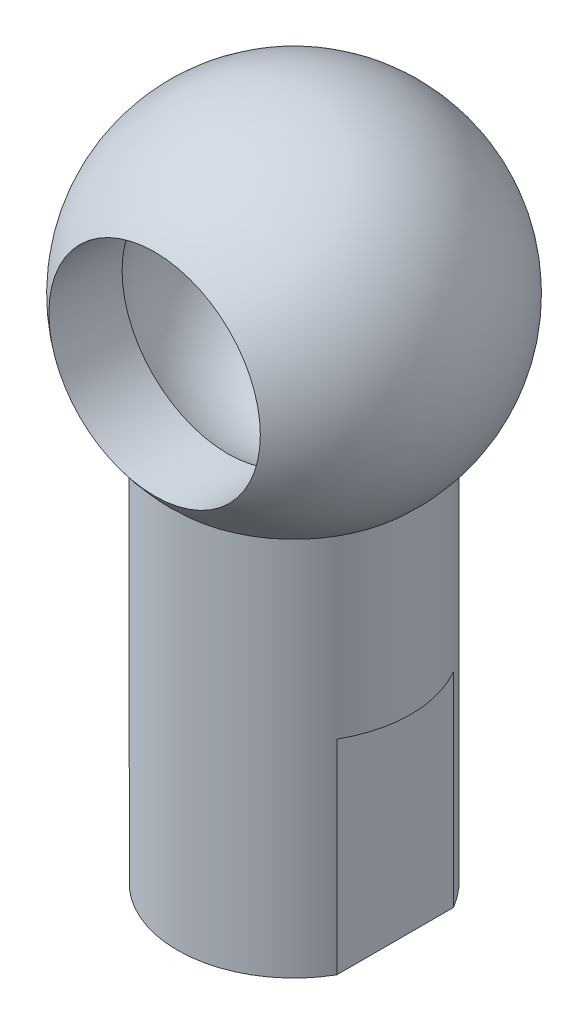
ISO-10303-21;
HEADER;
FILE_DESCRIPTION(('STEP AP214'),'2;1');
FILE_NAME('part.step','',(''),(''),'','','');
FILE_SCHEMA(('AUTOMOTIVE_DESIGN { 1 0 10303 214 1 1 1 1 }'));
ENDSEC;
DATA;
#1=APPLICATION_CONTEXT('core data for automotive mechanical design processes');
#2=APPLICATION_PROTOCOL_DEFINITION('international standard','automotive_design',2000,#1);
#3=PRODUCT_CONTEXT('',#1,'mechanical');
#4=PRODUCT('Part','Part','',(#3));
#5=PRODUCT_RELATED_PRODUCT_CATEGORY('part','',(#4));
#6=PRODUCT_DEFINITION_FORMATION('','',#4);
#7=PRODUCT_DEFINITION_CONTEXT('part definition',#1,'design');
#8=PRODUCT_DEFINITION('design','',#6,#7);
#9=PRODUCT_DEFINITION_SHAPE('','',#8);
#10=(LENGTH_UNIT() NAMED_UNIT(*) SI_UNIT(.MILLI.,.METRE.));
#11=(NAMED_UNIT(*) PLANE_ANGLE_UNIT() SI_UNIT($,.RADIAN.));
#12=(NAMED_UNIT(*) SI_UNIT($,.STERADIAN.) SOLID_ANGLE_UNIT());
#13=UNCERTAINTY_MEASURE_WITH_UNIT(LENGTH_MEASURE(1.E-05),#10,'distance_accuracy_value','');
#14=(GEOMETRIC_REPRESENTATION_CONTEXT(3) GLOBAL_UNCERTAINTY_ASSIGNED_CONTEXT((#13)) GLOBAL_UNIT_ASSIGNED_CONTEXT((#10,
#11,#12)) REPRESENTATION_CONTEXT('',''));
#15=CARTESIAN_POINT('',(0.,0.,0.));
#16=DIRECTION('',(0.,0.,1.));
#17=DIRECTION('',(1.,0.,0.));
#18=AXIS2_PLACEMENT_3D('',#15,#16,#17);
#19=CARTESIAN_POINT('',(0.,35.,0.));
#20=DIRECTION('',(0.,-1.,0.));
#21=DIRECTION('',(0.,0.,-1.));
#22=AXIS2_PLACEMENT_3D('',#19,#20,#21);
#23=CYLINDRICAL_SURFACE('',#22,8.);
#24=CARTESIAN_POINT('',(0.,14.,0.));
#25=DIRECTION('',(0.,1.,0.));
#26=DIRECTION('',(0.,0.,1.));
#27=AXIS2_PLACEMENT_3D('',#24,#25,#26);
#28=CIRCLE('',#27,8.);
#29=CARTESIAN_POINT('',(6.92820323027551,14.,4.));
#30=VERTEX_POINT('',#29);
#31=CARTESIAN_POINT('',(6.92820323027551,14.,-4.));
#32=VERTEX_POINT('',#31);
#33=EDGE_CURVE('E88',#30,#32,#28,.T.);
#34=ORIENTED_EDGE('',*,*,#33,.T.);
#35=DIRECTION('',(0.,-1.,0.));
#36=VECTOR('',#35,1.);
#37=CARTESIAN_POINT('',(6.92820323027551,14.,-4.));
#38=LINE('',#37,#36);
#39=CARTESIAN_POINT('',(6.92820323027551,0.,-4.));
#40=VERTEX_POINT('',#39);
#41=EDGE_CURVE('E93',#32,#40,#38,.T.);
#42=ORIENTED_EDGE('',*,*,#41,.T.);
#43=CARTESIAN_POINT('',(0.,0.,0.));
#44=DIRECTION('',(0.,1.,0.));
#45=DIRECTION('',(0.,0.,1.));
#46=AXIS2_PLACEMENT_3D('',#43,#44,#45);
#47=CIRCLE('',#46,8.);
#48=CARTESIAN_POINT('',(-6.92820323027551,0.,-4.));
#49=VERTEX_POINT('',#48);
#50=EDGE_CURVE('E53',#40,#49,#47,.T.);
#51=ORIENTED_EDGE('',*,*,#50,.T.);
#52=DIRECTION('',(0.,-1.,0.));
#53=VECTOR('',#52,1.);
#54=CARTESIAN_POINT('',(-6.92820323027551,14.,-4.));
#55=LINE('',#54,#53);
#56=CARTESIAN_POINT('',(-6.92820323027551,14.,-4.));
#57=VERTEX_POINT('',#56);
#58=EDGE_CURVE('E60',#57,#49,#55,.T.);
#59=ORIENTED_EDGE('',*,*,#58,.F.);
#60=CARTESIAN_POINT('',(0.,14.,0.));
#61=DIRECTION('',(0.,1.,0.));
#62=DIRECTION('',(0.,0.,1.));
#63=AXIS2_PLACEMENT_3D('',#60,#61,#62);
#64=CIRCLE('',#63,8.);
#65=CARTESIAN_POINT('',(-6.92820323027551,14.,4.));
#66=VERTEX_POINT('',#65);
#67=EDGE_CURVE('E109',#57,#66,#64,.T.);
#68=ORIENTED_EDGE('',*,*,#67,.T.);
#69=DIRECTION('',(0.,-1.,0.));
#70=VECTOR('',#69,1.);
#71=CARTESIAN_POINT('',(-6.92820323027551,14.,4.));
#72=LINE('',#71,#70);
#73=CARTESIAN_POINT('',(-6.92820323027551,0.,4.));
#74=VERTEX_POINT('',#73);
#75=EDGE_CURVE('E113',#66,#74,#72,.T.);
#76=ORIENTED_EDGE('',*,*,#75,.T.);
#77=CARTESIAN_POINT('',(6.92820323027551,0.,4.));
#78=VERTEX_POINT('',#77);
#79=EDGE_CURVE('E102',#74,#78,#47,.T.);
#80=ORIENTED_EDGE('',*,*,#79,.T.);
#81=DIRECTION('',(0.,-1.,0.));
#82=VECTOR('',#81,1.);
#83=CARTESIAN_POINT('',(6.92820323027551,14.,4.));
#84=LINE('',#83,#82);
#85=EDGE_CURVE('E68',#30,#78,#84,.T.);
#86=ORIENTED_EDGE('',*,*,#85,.F.);
#87=EDGE_LOOP('',(#34,#42,#51,#59,#68,#76,#80,#86));
#88=FACE_BOUND('',#87,.T.);
#89=CARTESIAN_POINT('',(0.,26.0557280900008,0.));
#90=DIRECTION('',(0.,1.,0.));
#91=DIRECTION('',(0.,0.,1.));
#92=AXIS2_PLACEMENT_3D('',#89,#90,#91);
#93=CIRCLE('',#92,8.);
#94=CARTESIAN_POINT('',(0.,26.0557280900008,8.));
#95=VERTEX_POINT('',#94);
#96=EDGE_CURVE('E12',#95,#95,#93,.T.);
#97=ORIENTED_EDGE('',*,*,#96,.F.);
#98=EDGE_LOOP('',(#97));
#99=FACE_BOUND('',#98,.T.);
#100=ADVANCED_FACE('F46',(#88,#99),#23,.T.);
#101=CARTESIAN_POINT('',(0.,0.,0.));
#102=DIRECTION('',(0.,1.,0.));
#103=DIRECTION('',(0.,0.,1.));
#104=AXIS2_PLACEMENT_3D('',#101,#102,#103);
#105=PLANE('',#104);
#106=CARTESIAN_POINT('',(0.,0.,0.));
#107=DIRECTION('',(0.,1.,0.));
#108=DIRECTION('',(0.,0.,1.));
#109=AXIS2_PLACEMENT_3D('',#106,#107,#108);
#110=CIRCLE('',#109,5.);
#111=CARTESIAN_POINT('',(0.,0.,5.));
#112=VERTEX_POINT('',#111);
#113=EDGE_CURVE('E118',#112,#112,#110,.T.);
#114=ORIENTED_EDGE('',*,*,#113,.T.);
#115=EDGE_LOOP('',(#114));
#116=FACE_BOUND('',#115,.T.);
#117=ORIENTED_EDGE('',*,*,#50,.F.);
#118=DIRECTION('',(0.,0.,-1.));
#119=VECTOR('',#118,1.);
#120=CARTESIAN_POINT('',(6.92820323027551,0.,0.));
#121=LINE('',#120,#119);
#122=EDGE_CURVE('E96',#78,#40,#121,.T.);
#123=ORIENTED_EDGE('',*,*,#122,.F.);
#124=ORIENTED_EDGE('',*,*,#79,.F.);
#125=DIRECTION('',(0.,0.,-1.));
#126=VECTOR('',#125,1.);
#127=CARTESIAN_POINT('',(-6.92820323027551,0.,0.));
#128=LINE('',#127,#126);
#129=EDGE_CURVE('E110',#74,#49,#128,.T.);
#130=ORIENTED_EDGE('',*,*,#129,.T.);
#131=EDGE_LOOP('',(#117,#123,#124,#130));
#132=FACE_BOUND('',#131,.T.);
#133=ADVANCED_FACE('F139',(#116,#132),#105,.F.);
#134=CARTESIAN_POINT('',(-6.92820323027551,14.,0.));
#135=DIRECTION('',(-1.,0.,0.));
#136=DIRECTION('',(0.,0.,1.));
#137=AXIS2_PLACEMENT_3D('',#134,#135,#136);
#138=PLANE('',#137);
#139=ORIENTED_EDGE('',*,*,#129,.F.);
#140=ORIENTED_EDGE('',*,*,#75,.F.);
#141=DIRECTION('',(0.,0.,-1.));
#142=VECTOR('',#141,1.);
#143=CARTESIAN_POINT('',(-6.92820323027551,14.,0.));
#144=LINE('',#143,#142);
#145=EDGE_CURVE('E107',#66,#57,#144,.T.);
#146=ORIENTED_EDGE('',*,*,#145,.T.);
#147=ORIENTED_EDGE('',*,*,#58,.T.);
#148=EDGE_LOOP('',(#139,#140,#146,#147));
#149=FACE_BOUND('',#148,.T.);
#150=ADVANCED_FACE('F143',(#149),#138,.T.);
#151=CARTESIAN_POINT('',(0.,14.,0.));
#152=DIRECTION('',(0.,1.,0.));
#153=DIRECTION('',(0.,0.,1.));
#154=AXIS2_PLACEMENT_3D('',#151,#152,#153);
#155=PLANE('',#154);
#156=ORIENTED_EDGE('',*,*,#145,.F.);
#157=ORIENTED_EDGE('',*,*,#67,.F.);
#158=EDGE_LOOP('',(#156,#157));
#159=FACE_BOUND('',#158,.T.);
#160=ADVANCED_FACE('F148',(#159),#155,.F.);
#161=CARTESIAN_POINT('',(6.92820323027551,14.,0.));
#162=DIRECTION('',(-1.,0.,0.));
#163=DIRECTION('',(0.,0.,1.));
#164=AXIS2_PLACEMENT_3D('',#161,#162,#163);
#165=PLANE('',#164);
#166=ORIENTED_EDGE('',*,*,#122,.T.);
#167=ORIENTED_EDGE('',*,*,#41,.F.);
#168=DIRECTION('',(0.,0.,-1.));
#169=VECTOR('',#168,1.);
#170=CARTESIAN_POINT('',(6.92820323027551,14.,0.));
#171=LINE('',#170,#169);
#172=EDGE_CURVE('E90',#30,#32,#171,.T.);
#173=ORIENTED_EDGE('',*,*,#172,.F.);
#174=ORIENTED_EDGE('',*,*,#85,.T.);
#175=EDGE_LOOP('',(#166,#167,#173,#174));
#176=FACE_BOUND('',#175,.T.);
#177=ADVANCED_FACE('F95',(#176),#165,.F.);
#178=CARTESIAN_POINT('',(0.,14.,0.));
#179=DIRECTION('',(0.,1.,0.));
#180=DIRECTION('',(0.,0.,1.));
#181=AXIS2_PLACEMENT_3D('',#178,#179,#180);
#182=PLANE('',#181);
#183=ORIENTED_EDGE('',*,*,#172,.T.);
#184=ORIENTED_EDGE('',*,*,#33,.F.);
#185=EDGE_LOOP('',(#183,#184));
#186=FACE_BOUND('',#185,.T.);
#187=ADVANCED_FACE('F89',(#186),#182,.F.);
#188=CARTESIAN_POINT('',(0.,15.5,0.));
#189=DIRECTION('',(0.,-1.,0.));
#190=DIRECTION('',(0.,0.,-1.));
#191=AXIS2_PLACEMENT_3D('',#188,#189,#190);
#192=CYLINDRICAL_SURFACE('',#191,5.);
#193=CARTESIAN_POINT('',(0.,15.5,0.));
#194=DIRECTION('',(0.,1.,0.));
#195=DIRECTION('',(0.,0.,1.));
#196=AXIS2_PLACEMENT_3D('',#193,#194,#195);
#197=CIRCLE('',#196,5.);
#198=CARTESIAN_POINT('',(0.,15.5,5.));
#199=VERTEX_POINT('',#198);
#200=EDGE_CURVE('E115',#199,#199,#197,.T.);
#201=ORIENTED_EDGE('',*,*,#200,.T.);
#202=EDGE_LOOP('',(#201));
#203=FACE_BOUND('',#202,.T.);
#204=ORIENTED_EDGE('',*,*,#113,.F.);
#205=EDGE_LOOP('',(#204));
#206=FACE_BOUND('',#205,.T.);
#207=ADVANCED_FACE('F159',(#203,#206),#192,.F.);
#208=CARTESIAN_POINT('',(0.,15.5,0.));
#209=DIRECTION('',(0.,1.,0.));
#210=DIRECTION('',(0.,0.,1.));
#211=AXIS2_PLACEMENT_3D('',#208,#209,#210);
#212=PLANE('',#211);
#213=ORIENTED_EDGE('',*,*,#200,.F.);
#214=EDGE_LOOP('',(#213));
#215=FACE_BOUND('',#214,.T.);
#216=ADVANCED_FACE('F135',(#215),#212,.F.);
#217=CARTESIAN_POINT('',(0.,35.,0.));
#218=DIRECTION('',(0.,-1.,0.));
#219=DIRECTION('',(0.,0.,1.));
#220=AXIS2_PLACEMENT_3D('',#217,#218,#219);
#221=SPHERICAL_SURFACE('',#220,12.);
#222=CARTESIAN_POINT('',(0.,35.,9.56229574945264));
#223=DIRECTION('',(0.,0.,-1.));
#224=DIRECTION('',(-1.,0.,0.));
#225=AXIS2_PLACEMENT_3D('',#222,#223,#224);
#226=CIRCLE('',#225,7.25);
#227=CARTESIAN_POINT('',(-7.25,35.,9.56229574945264));
#228=VERTEX_POINT('',#227);
#229=EDGE_CURVE('E121',#228,#228,#226,.F.);
#230=ORIENTED_EDGE('',*,*,#229,.F.);
#231=EDGE_LOOP('',(#230));
#232=FACE_BOUND('',#231,.T.);
#233=ORIENTED_EDGE('',*,*,#96,.T.);
#234=EDGE_LOOP('',(#233));
#235=FACE_BOUND('',#234,.T.);
#236=ADVANCED_FACE('F132',(#232,#235),#221,.T.);
#237=CARTESIAN_POINT('',(0.,35.,-12.001));
#238=DIRECTION('',(0.,0.,1.));
#239=DIRECTION('',(1.,0.,0.));
#240=AXIS2_PLACEMENT_3D('',#237,#238,#239);
#241=CYLINDRICAL_SURFACE('',#240,7.25);
#242=CARTESIAN_POINT('',(0.,35.,4.54193731461717));
#243=DIRECTION('',(0.,0.,-1.));
#244=DIRECTION('',(-1.,0.,0.));
#245=AXIS2_PLACEMENT_3D('',#242,#243,#244);
#246=CIRCLE('',#245,7.25);
#247=CARTESIAN_POINT('',(-7.25,35.,4.54193731461717));
#248=VERTEX_POINT('',#247);
#249=EDGE_CURVE('E124',#248,#248,#246,.T.);
#250=ORIENTED_EDGE('',*,*,#249,.T.);
#251=EDGE_LOOP('',(#250));
#252=FACE_BOUND('',#251,.T.);
#253=ORIENTED_EDGE('',*,*,#229,.T.);
#254=EDGE_LOOP('',(#253));
#255=FACE_BOUND('',#254,.T.);
#256=ADVANCED_FACE('F130',(#252,#255),#241,.F.);
#257=CARTESIAN_POINT('',(0.,35.,1.16));
#258=DIRECTION('',(0.,1.,0.));
#259=DIRECTION('',(0.,0.,-1.));
#260=AXIS2_PLACEMENT_3D('',#257,#258,#259);
#261=SPHERICAL_SURFACE('',#260,8.);
#262=CARTESIAN_POINT('',(0.,35.,1.16));
#263=DIRECTION('',(0.,0.,-1.));
#264=DIRECTION('',(-1.,0.,0.));
#265=AXIS2_PLACEMENT_3D('',#262,#263,#264);
#266=SPHERICAL_SURFACE('',#265,8.);
#267=ORIENTED_EDGE('',*,*,#249,.F.);
#268=EDGE_LOOP('',(#267));
#269=FACE_BOUND('',#268,.T.);
#270=ADVANCED_FACE('F166',(#269),#266,.F.);
#271=CLOSED_SHELL('',(#100,#133,#150,#160,#177,#187,#207,#216,#236,#256,#270));
#272=MANIFOLD_SOLID_BREP('B2',#271);
#273=ADVANCED_BREP_SHAPE_REPRESENTATION('',(#18,#272),#14);
#274=SHAPE_DEFINITION_REPRESENTATION(#9,#273);
ENDSEC;
END-ISO-10303-21;
